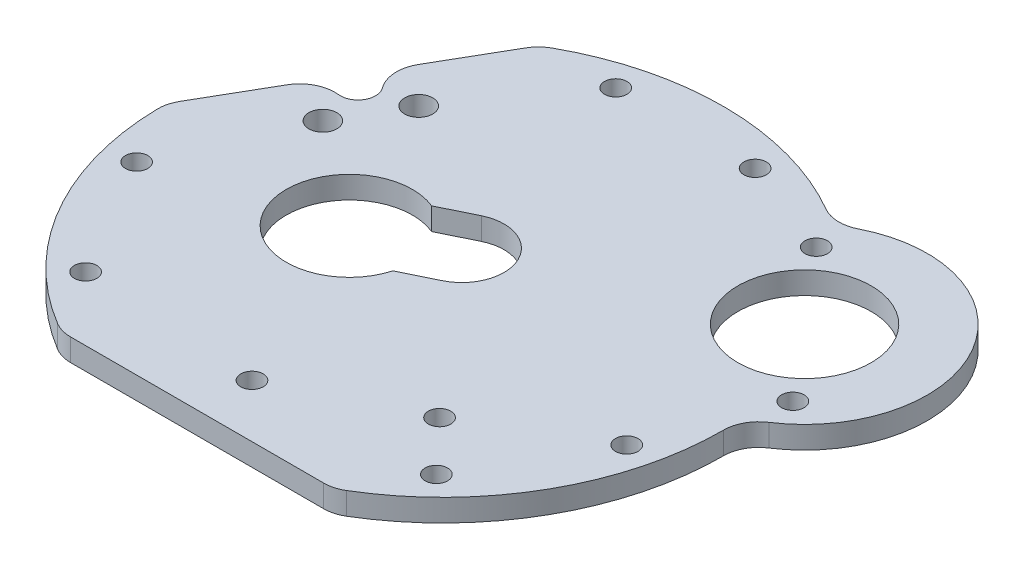
ISO-10303-21;
HEADER;
FILE_DESCRIPTION(('STEP AP214'),'2;1');
FILE_NAME('part.step','',(''),(''),'','','');
FILE_SCHEMA(('AUTOMOTIVE_DESIGN { 1 0 10303 214 1 1 1 1 }'));
ENDSEC;
DATA;
#1=APPLICATION_CONTEXT('core data for automotive mechanical design processes');
#2=APPLICATION_PROTOCOL_DEFINITION('international standard','automotive_design',2000,#1);
#3=PRODUCT_CONTEXT('',#1,'mechanical');
#4=PRODUCT('Part','Part','',(#3));
#5=PRODUCT_RELATED_PRODUCT_CATEGORY('part','',(#4));
#6=PRODUCT_DEFINITION_FORMATION('','',#4);
#7=PRODUCT_DEFINITION_CONTEXT('part definition',#1,'design');
#8=PRODUCT_DEFINITION('design','',#6,#7);
#9=PRODUCT_DEFINITION_SHAPE('','',#8);
#10=(LENGTH_UNIT() NAMED_UNIT(*) SI_UNIT(.MILLI.,.METRE.));
#11=(NAMED_UNIT(*) PLANE_ANGLE_UNIT() SI_UNIT($,.RADIAN.));
#12=(NAMED_UNIT(*) SI_UNIT($,.STERADIAN.) SOLID_ANGLE_UNIT());
#13=UNCERTAINTY_MEASURE_WITH_UNIT(LENGTH_MEASURE(1.E-05),#10,'distance_accuracy_value','');
#14=(GEOMETRIC_REPRESENTATION_CONTEXT(3) GLOBAL_UNCERTAINTY_ASSIGNED_CONTEXT((#13)) GLOBAL_UNIT_ASSIGNED_CONTEXT((#10,
#11,#12)) REPRESENTATION_CONTEXT('',''));
#15=CARTESIAN_POINT('',(0.,0.,0.));
#16=DIRECTION('',(0.,0.,1.));
#17=DIRECTION('',(1.,0.,0.));
#18=AXIS2_PLACEMENT_3D('',#15,#16,#17);
#19=CARTESIAN_POINT('',(-30.3108891324554,3.175,-17.5));
#20=DIRECTION('',(0.866025403784439,0.,0.5));
#21=DIRECTION('',(0.5,0.,-0.866025403784439));
#22=AXIS2_PLACEMENT_3D('',#19,#20,#21);
#23=PLANE('',#22);
#24=DIRECTION('',(-0.5,0.,0.866025403784439));
#25=VECTOR('',#24,1.);
#26=CARTESIAN_POINT('',(-30.3108891324554,3.175,-17.5));
#27=LINE('',#26,#25);
#28=CARTESIAN_POINT('',(-21.2970109437954,3.175,-33.112494995996));
#29=VERTEX_POINT('',#28);
#30=CARTESIAN_POINT('',(-26.8739573612385,3.175,-23.4529404498953));
#31=VERTEX_POINT('',#30);
#32=EDGE_CURVE('E221',#29,#31,#27,.T.);
#33=ORIENTED_EDGE('',*,*,#32,.F.);
#34=DIRECTION('',(0.,-1.,0.));
#35=VECTOR('',#34,1.);
#36=CARTESIAN_POINT('',(-21.2970109437954,3.175,-33.112494995996));
#37=LINE('',#36,#35);
#38=CARTESIAN_POINT('',(-21.2970109437954,0.,-33.112494995996));
#39=VERTEX_POINT('',#38);
#40=EDGE_CURVE('E370',#29,#39,#37,.T.);
#41=ORIENTED_EDGE('',*,*,#40,.T.);
#42=DIRECTION('',(-0.5,0.,0.866025403784439));
#43=VECTOR('',#42,1.);
#44=CARTESIAN_POINT('',(-30.3108891324554,0.,-17.5));
#45=LINE('',#44,#43);
#46=CARTESIAN_POINT('',(-26.8739573612385,0.,-23.4529404498953));
#47=VERTEX_POINT('',#46);
#48=EDGE_CURVE('E290',#39,#47,#45,.T.);
#49=ORIENTED_EDGE('',*,*,#48,.T.);
#50=DIRECTION('',(0.,1.,0.));
#51=VECTOR('',#50,1.);
#52=CARTESIAN_POINT('',(-26.8739573612385,3.175,-23.4529404498953));
#53=LINE('',#52,#51);
#54=EDGE_CURVE('E51',#47,#31,#53,.T.);
#55=ORIENTED_EDGE('',*,*,#54,.T.);
#56=EDGE_LOOP('',(#33,#41,#49,#55));
#57=FACE_BOUND('',#56,.T.);
#58=ADVANCED_FACE('F36',(#57),#23,.F.);
#59=CARTESIAN_POINT('',(32.7031788014801,3.175,-18.8811890843912));
#60=DIRECTION('',(0.,-1.,0.));
#61=DIRECTION('',(0.,0.,-1.));
#62=AXIS2_PLACEMENT_3D('',#59,#60,#61);
#63=CYLINDRICAL_SURFACE('',#62,17.5);
#64=CARTESIAN_POINT('',(32.7031788014801,0.,-18.8811890843912));
#65=DIRECTION('',(0.,1.,0.));
#66=DIRECTION('',(0.,0.,1.));
#67=AXIS2_PLACEMENT_3D('',#64,#65,#66);
#68=CIRCLE('',#67,17.5);
#69=CARTESIAN_POINT('',(42.267360109847,0.,-4.22593624110372));
#70=VERTEX_POINT('',#69);
#71=CARTESIAN_POINT('',(24.7934481944923,0.,-34.4916394854809));
#72=VERTEX_POINT('',#71);
#73=EDGE_CURVE('E281',#70,#72,#68,.T.);
#74=ORIENTED_EDGE('',*,*,#73,.T.);
#75=DIRECTION('',(0.,-1.,0.));
#76=VECTOR('',#75,1.);
#77=CARTESIAN_POINT('',(24.7934481944923,3.175,-34.4916394854809));
#78=LINE('',#77,#76);
#79=CARTESIAN_POINT('',(24.7934481944923,3.175,-34.4916394854809));
#80=VERTEX_POINT('',#79);
#81=EDGE_CURVE('E311',#72,#80,#78,.F.);
#82=ORIENTED_EDGE('',*,*,#81,.T.);
#83=CARTESIAN_POINT('',(32.7031788014801,3.175,-18.8811890843912));
#84=DIRECTION('',(0.,1.,0.));
#85=DIRECTION('',(0.,0.,1.));
#86=AXIS2_PLACEMENT_3D('',#83,#84,#85);
#87=CIRCLE('',#86,17.5);
#88=CARTESIAN_POINT('',(42.267360109847,3.175,-4.22593624110372));
#89=VERTEX_POINT('',#88);
#90=EDGE_CURVE('E214',#89,#80,#87,.T.);
#91=ORIENTED_EDGE('',*,*,#90,.F.);
#92=DIRECTION('',(0.,-1.,0.));
#93=VECTOR('',#92,1.);
#94=CARTESIAN_POINT('',(42.267360109847,3.175,-4.22593624110372));
#95=LINE('',#94,#93);
#96=EDGE_CURVE('E308',#89,#70,#95,.T.);
#97=ORIENTED_EDGE('',*,*,#96,.T.);
#98=EDGE_LOOP('',(#74,#82,#91,#97));
#99=FACE_BOUND('',#98,.T.);
#100=ADVANCED_FACE('F474',(#99),#63,.T.);
#101=CARTESIAN_POINT('',(0.,3.175,0.));
#102=DIRECTION('',(0.,-1.,0.));
#103=DIRECTION('',(0.,0.,-1.));
#104=AXIS2_PLACEMENT_3D('',#101,#102,#103);
#105=CYLINDRICAL_SURFACE('',#104,40.);
#106=CARTESIAN_POINT('',(0.,0.,0.));
#107=DIRECTION('',(0.,1.,0.));
#108=DIRECTION('',(0.,0.,1.));
#109=AXIS2_PLACEMENT_3D('',#106,#107,#108);
#110=CIRCLE('',#109,40.);
#111=CARTESIAN_POINT('',(20.0298001457105,0.,-34.623793930228));
#112=VERTEX_POINT('',#111);
#113=CARTESIAN_POINT('',(-19.3907244855694,0.,-34.9857085668525));
#114=VERTEX_POINT('',#113);
#115=EDGE_CURVE('E284',#112,#114,#110,.T.);
#116=ORIENTED_EDGE('',*,*,#115,.T.);
#117=DIRECTION('',(0.,-1.,0.));
#118=VECTOR('',#117,1.);
#119=CARTESIAN_POINT('',(-19.3907244855694,3.175,-34.9857085668525));
#120=LINE('',#119,#118);
#121=CARTESIAN_POINT('',(-19.3907244855694,3.175,-34.9857085668525));
#122=VERTEX_POINT('',#121);
#123=EDGE_CURVE('E373',#114,#122,#120,.F.);
#124=ORIENTED_EDGE('',*,*,#123,.T.);
#125=CARTESIAN_POINT('',(0.,3.175,0.));
#126=DIRECTION('',(0.,1.,0.));
#127=DIRECTION('',(0.,0.,1.));
#128=AXIS2_PLACEMENT_3D('',#125,#126,#127);
#129=CIRCLE('',#128,40.);
#130=CARTESIAN_POINT('',(20.0298001457105,3.175,-34.623793930228));
#131=VERTEX_POINT('',#130);
#132=EDGE_CURVE('E218',#131,#122,#129,.T.);
#133=ORIENTED_EDGE('',*,*,#132,.F.);
#134=DIRECTION('',(0.,-1.,0.));
#135=VECTOR('',#134,1.);
#136=CARTESIAN_POINT('',(20.0298001457105,3.175,-34.623793930228));
#137=LINE('',#136,#135);
#138=EDGE_CURVE('E186',#131,#112,#137,.T.);
#139=ORIENTED_EDGE('',*,*,#138,.T.);
#140=EDGE_LOOP('',(#116,#124,#133,#139));
#141=FACE_BOUND('',#140,.T.);
#142=ADVANCED_FACE('F480',(#141),#105,.T.);
#143=CARTESIAN_POINT('',(-33.7478209036722,0.,-11.5470595501047));
#144=VERTEX_POINT('',#143);
#145=CARTESIAN_POINT('',(-39.3247673211153,0.,-1.88750500400403));
#146=VERTEX_POINT('',#145);
#147=EDGE_CURVE('E287',#144,#146,#45,.T.);
#148=ORIENTED_EDGE('',*,*,#147,.T.);
#149=DIRECTION('',(0.,-1.,0.));
#150=VECTOR('',#149,1.);
#151=CARTESIAN_POINT('',(-39.3247673211153,3.175,-1.88750500400403));
#152=LINE('',#151,#150);
#153=CARTESIAN_POINT('',(-39.3247673211153,3.175,-1.88750500400403));
#154=VERTEX_POINT('',#153);
#155=EDGE_CURVE('E367',#146,#154,#152,.F.);
#156=ORIENTED_EDGE('',*,*,#155,.T.);
#157=CARTESIAN_POINT('',(-33.7478209036722,3.175,-11.5470595501047));
#158=VERTEX_POINT('',#157);
#159=EDGE_CURVE('E220',#158,#154,#27,.T.);
#160=ORIENTED_EDGE('',*,*,#159,.F.);
#161=DIRECTION('',(0.,1.,0.));
#162=VECTOR('',#161,1.);
#163=CARTESIAN_POINT('',(-33.7478209036722,3.175,-11.5470595501047));
#164=LINE('',#163,#162);
#165=EDGE_CURVE('E365',#158,#144,#164,.F.);
#166=ORIENTED_EDGE('',*,*,#165,.T.);
#167=EDGE_LOOP('',(#148,#156,#160,#166));
#168=FACE_BOUND('',#167,.T.);
#169=ADVANCED_FACE('F476',(#168),#23,.F.);
#170=CARTESIAN_POINT('',(0.,3.175,0.));
#171=DIRECTION('',(0.,-1.,0.));
#172=DIRECTION('',(0.,0.,-1.));
#173=AXIS2_PLACEMENT_3D('',#170,#171,#172);
#174=CYLINDRICAL_SURFACE('',#173,40.);
#175=CARTESIAN_POINT('',(0.,0.,0.));
#176=DIRECTION('',(0.,1.,0.));
#177=DIRECTION('',(0.,0.,1.));
#178=AXIS2_PLACEMENT_3D('',#175,#176,#177);
#179=CIRCLE('',#178,40.);
#180=CARTESIAN_POINT('',(-39.9938746310779,0.,0.699994281138249));
#181=VERTEX_POINT('',#180);
#182=CARTESIAN_POINT('',(-20.6031501455085,0.,34.2857142857143));
#183=VERTEX_POINT('',#182);
#184=EDGE_CURVE('E291',#181,#183,#179,.T.);
#185=ORIENTED_EDGE('',*,*,#184,.T.);
#186=DIRECTION('',(0.,-1.,0.));
#187=VECTOR('',#186,1.);
#188=CARTESIAN_POINT('',(-20.6031501455085,3.175,34.2857142857143));
#189=LINE('',#188,#187);
#190=CARTESIAN_POINT('',(-20.6031501455085,3.175,34.2857142857143));
#191=VERTEX_POINT('',#190);
#192=EDGE_CURVE('E363',#183,#191,#189,.F.);
#193=ORIENTED_EDGE('',*,*,#192,.T.);
#194=CARTESIAN_POINT('',(0.,3.175,0.));
#195=DIRECTION('',(0.,1.,0.));
#196=DIRECTION('',(0.,0.,1.));
#197=AXIS2_PLACEMENT_3D('',#194,#195,#196);
#198=CIRCLE('',#197,40.);
#199=CARTESIAN_POINT('',(-39.9938746310779,3.175,0.699994281138249));
#200=VERTEX_POINT('',#199);
#201=EDGE_CURVE('E223',#200,#191,#198,.T.);
#202=ORIENTED_EDGE('',*,*,#201,.F.);
#203=DIRECTION('',(0.,-1.,0.));
#204=VECTOR('',#203,1.);
#205=CARTESIAN_POINT('',(-39.9938746310778,3.175,0.699994281138249));
#206=LINE('',#205,#204);
#207=EDGE_CURVE('E360',#200,#181,#206,.T.);
#208=ORIENTED_EDGE('',*,*,#207,.T.);
#209=EDGE_LOOP('',(#185,#193,#202,#208));
#210=FACE_BOUND('',#209,.T.);
#211=ADVANCED_FACE('F486',(#210),#174,.T.);
#212=CARTESIAN_POINT('',(0.,3.175,35.));
#213=DIRECTION('',(0.,0.,-1.));
#214=DIRECTION('',(-1.,0.,0.));
#215=AXIS2_PLACEMENT_3D('',#212,#213,#214);
#216=PLANE('',#215);
#217=DIRECTION('',(1.,0.,0.));
#218=VECTOR('',#217,1.);
#219=CARTESIAN_POINT('',(0.,0.,35.));
#220=LINE('',#219,#218);
#221=CARTESIAN_POINT('',(-18.0277563773199,0.,35.));
#222=VERTEX_POINT('',#221);
#223=CARTESIAN_POINT('',(18.0277563773199,0.,35.));
#224=VERTEX_POINT('',#223);
#225=EDGE_CURVE('E294',#222,#224,#220,.T.);
#226=ORIENTED_EDGE('',*,*,#225,.T.);
#227=DIRECTION('',(0.,-1.,0.));
#228=VECTOR('',#227,1.);
#229=CARTESIAN_POINT('',(18.0277563773199,3.175,35.));
#230=LINE('',#229,#228);
#231=CARTESIAN_POINT('',(18.0277563773199,3.175,35.));
#232=VERTEX_POINT('',#231);
#233=EDGE_CURVE('E347',#224,#232,#230,.F.);
#234=ORIENTED_EDGE('',*,*,#233,.T.);
#235=DIRECTION('',(1.,0.,0.));
#236=VECTOR('',#235,1.);
#237=CARTESIAN_POINT('',(0.,3.175,35.));
#238=LINE('',#237,#236);
#239=CARTESIAN_POINT('',(-18.0277563773199,3.175,35.));
#240=VERTEX_POINT('',#239);
#241=EDGE_CURVE('E226',#240,#232,#238,.T.);
#242=ORIENTED_EDGE('',*,*,#241,.F.);
#243=DIRECTION('',(0.,-1.,0.));
#244=VECTOR('',#243,1.);
#245=CARTESIAN_POINT('',(-18.0277563773199,3.175,35.));
#246=LINE('',#245,#244);
#247=EDGE_CURVE('E344',#240,#222,#246,.T.);
#248=ORIENTED_EDGE('',*,*,#247,.T.);
#249=EDGE_LOOP('',(#226,#234,#242,#248));
#250=FACE_BOUND('',#249,.T.);
#251=ADVANCED_FACE('F492',(#250),#216,.F.);
#252=CARTESIAN_POINT('',(-1.1036926971255,3.175,-3.84471877129028));
#253=DIRECTION('',(0.,-1.,0.));
#254=DIRECTION('',(0.,0.,-1.));
#255=AXIS2_PLACEMENT_3D('',#252,#253,#254);
#256=CYLINDRICAL_SURFACE('',#255,5.99999999999999);
#257=CARTESIAN_POINT('',(-1.1036926971255,0.,-3.84471877129028));
#258=DIRECTION('',(0.,1.,0.));
#259=DIRECTION('',(0.,0.,1.));
#260=AXIS2_PLACEMENT_3D('',#257,#258,#259);
#261=CIRCLE('',#260,5.99999999999999);
#262=CARTESIAN_POINT('',(1.52653418360897,0.,1.54804550650471));
#263=VERTEX_POINT('',#262);
#264=CARTESIAN_POINT('',(-3.73391957785997,0.,-9.23748304908527));
#265=VERTEX_POINT('',#264);
#266=EDGE_CURVE('E182',#263,#265,#261,.T.);
#267=ORIENTED_EDGE('',*,*,#266,.F.);
#268=DIRECTION('',(0.,-1.,0.));
#269=VECTOR('',#268,1.);
#270=CARTESIAN_POINT('',(1.52653418360897,3.175,1.54804550650471));
#271=LINE('',#270,#269);
#272=CARTESIAN_POINT('',(1.52653418360897,3.175,1.54804550650471));
#273=VERTEX_POINT('',#272);
#274=EDGE_CURVE('E175',#273,#263,#271,.T.);
#275=ORIENTED_EDGE('',*,*,#274,.F.);
#276=CARTESIAN_POINT('',(-1.1036926971255,3.175,-3.84471877129028));
#277=DIRECTION('',(0.,1.,0.));
#278=DIRECTION('',(0.,0.,1.));
#279=AXIS2_PLACEMENT_3D('',#276,#277,#278);
#280=CIRCLE('',#279,5.99999999999999);
#281=CARTESIAN_POINT('',(-3.73391957785997,3.175,-9.23748304908527));
#282=VERTEX_POINT('',#281);
#283=EDGE_CURVE('E179',#273,#282,#280,.T.);
#284=ORIENTED_EDGE('',*,*,#283,.T.);
#285=DIRECTION('',(0.,-1.,0.));
#286=VECTOR('',#285,1.);
#287=CARTESIAN_POINT('',(-3.73391957785997,3.175,-9.23748304908527));
#288=LINE('',#287,#286);
#289=EDGE_CURVE('E231',#282,#265,#288,.T.);
#290=ORIENTED_EDGE('',*,*,#289,.T.);
#291=EDGE_LOOP('',(#267,#275,#284,#290));
#292=FACE_BOUND('',#291,.T.);
#293=ADVANCED_FACE('F177',(#292),#256,.F.);
#294=CARTESIAN_POINT('',(0.903291201095751,3.175,1.85202141967139));
#295=DIRECTION('',(0.438371146789079,0.,0.898794046299166));
#296=DIRECTION('',(0.898794046299166,0.,-0.438371146789079));
#297=AXIS2_PLACEMENT_3D('',#294,#295,#296);
#298=PLANE('',#297);
#299=DIRECTION('',(-0.898794046299166,0.,0.438371146789079));
#300=VECTOR('',#299,1.);
#301=CARTESIAN_POINT('',(0.903291201095751,0.,1.85202141967139));
#302=LINE('',#301,#300);
#303=CARTESIAN_POINT('',(-3.22970061608986,0.,3.86781621718886));
#304=VERTEX_POINT('',#303);
#305=EDGE_CURVE('E272',#263,#304,#302,.T.);
#306=ORIENTED_EDGE('',*,*,#305,.T.);
#307=DIRECTION('',(0.,-1.,0.));
#308=VECTOR('',#307,1.);
#309=CARTESIAN_POINT('',(-3.22970061608986,3.175,3.86781621718886));
#310=LINE('',#309,#308);
#311=CARTESIAN_POINT('',(-3.22970061608986,3.175,3.86781621718886));
#312=VERTEX_POINT('',#311);
#313=EDGE_CURVE('E187',#312,#304,#310,.T.);
#314=ORIENTED_EDGE('',*,*,#313,.F.);
#315=DIRECTION('',(-0.898794046299166,0.,0.438371146789079));
#316=VECTOR('',#315,1.);
#317=CARTESIAN_POINT('',(0.903291201095751,3.175,1.85202141967139));
#318=LINE('',#317,#316);
#319=EDGE_CURVE('E190',#273,#312,#318,.T.);
#320=ORIENTED_EDGE('',*,*,#319,.F.);
#321=ORIENTED_EDGE('',*,*,#274,.T.);
#322=EDGE_LOOP('',(#306,#314,#320,#321));
#323=FACE_BOUND('',#322,.T.);
#324=ADVANCED_FACE('F191',(#323),#298,.F.);
#325=CARTESIAN_POINT('',(-11.8892212527155,3.175,1.41573499017866));
#326=DIRECTION('',(0.,-1.,0.));
#327=DIRECTION('',(0.,0.,-1.));
#328=AXIS2_PLACEMENT_3D('',#325,#326,#327);
#329=CYLINDRICAL_SURFACE('',#328,9.00000000000007);
#330=CARTESIAN_POINT('',(-11.8892212527155,0.,1.41573499017866));
#331=DIRECTION('',(0.,1.,0.));
#332=DIRECTION('',(0.,0.,1.));
#333=AXIS2_PLACEMENT_3D('',#330,#331,#332);
#334=CIRCLE('',#333,9.00000000000007);
#335=CARTESIAN_POINT('',(-8.49015437755879,0.,-6.91771233840112));
#336=VERTEX_POINT('',#335);
#337=EDGE_CURVE('E275',#336,#304,#334,.T.);
#338=ORIENTED_EDGE('',*,*,#337,.F.);
#339=DIRECTION('',(0.,-1.,0.));
#340=VECTOR('',#339,1.);
#341=CARTESIAN_POINT('',(-8.49015437755879,3.175,-6.91771233840112));
#342=LINE('',#341,#340);
#343=CARTESIAN_POINT('',(-8.49015437755879,3.175,-6.91771233840112));
#344=VERTEX_POINT('',#343);
#345=EDGE_CURVE('E303',#344,#336,#342,.T.);
#346=ORIENTED_EDGE('',*,*,#345,.F.);
#347=CARTESIAN_POINT('',(-11.8892212527155,3.175,1.41573499017866));
#348=DIRECTION('',(0.,1.,0.));
#349=DIRECTION('',(0.,0.,1.));
#350=AXIS2_PLACEMENT_3D('',#347,#348,#349);
#351=CIRCLE('',#350,9.00000000000007);
#352=EDGE_CURVE('E195',#344,#312,#351,.T.);
#353=ORIENTED_EDGE('',*,*,#352,.T.);
#354=ORIENTED_EDGE('',*,*,#313,.T.);
#355=EDGE_LOOP('',(#338,#346,#353,#354));
#356=FACE_BOUND('',#355,.T.);
#357=ADVANCED_FACE('F464',(#356),#329,.F.);
#358=CARTESIAN_POINT('',(-4.35716256037318,3.175,-8.93350713591859));
#359=DIRECTION('',(0.438371146789078,0.,0.898794046299167));
#360=DIRECTION('',(0.898794046299167,0.,-0.438371146789078));
#361=AXIS2_PLACEMENT_3D('',#358,#359,#360);
#362=PLANE('',#361);
#363=DIRECTION('',(-0.898794046299167,0.,0.438371146789078));
#364=VECTOR('',#363,1.);
#365=CARTESIAN_POINT('',(-4.35716256037318,0.,-8.93350713591859));
#366=LINE('',#365,#364);
#367=EDGE_CURVE('E278',#265,#336,#366,.T.);
#368=ORIENTED_EDGE('',*,*,#367,.F.);
#369=ORIENTED_EDGE('',*,*,#289,.F.);
#370=DIRECTION('',(-0.898794046299167,0.,0.438371146789078));
#371=VECTOR('',#370,1.);
#372=CARTESIAN_POINT('',(-4.35716256037318,3.175,-8.93350713591859));
#373=LINE('',#372,#371);
#374=EDGE_CURVE('E199',#282,#344,#373,.T.);
#375=ORIENTED_EDGE('',*,*,#374,.T.);
#376=ORIENTED_EDGE('',*,*,#345,.T.);
#377=EDGE_LOOP('',(#368,#369,#375,#376));
#378=FACE_BOUND('',#377,.T.);
#379=ADVANCED_FACE('F451',(#378),#362,.T.);
#380=CARTESIAN_POINT('',(-34.9332342741632,3.175,8.69880124766783));
#381=DIRECTION('',(0.,-1.,0.));
#382=DIRECTION('',(0.,0.,-1.));
#383=AXIS2_PLACEMENT_3D('',#380,#381,#382);
#384=CYLINDRICAL_SURFACE('',#383,1.599999999409);
#385=CARTESIAN_POINT('',(-34.9332342741632,3.175,8.69880124766783));
#386=DIRECTION('',(0.,1.,0.));
#387=DIRECTION('',(0.,0.,1.));
#388=AXIS2_PLACEMENT_3D('',#385,#386,#387);
#389=CIRCLE('',#388,1.599999999409);
#390=CARTESIAN_POINT('',(-34.9332342741632,3.175,10.2988012470768));
#391=VERTEX_POINT('',#390);
#392=EDGE_CURVE('E201',#391,#391,#389,.T.);
#393=ORIENTED_EDGE('',*,*,#392,.T.);
#394=EDGE_LOOP('',(#393));
#395=FACE_BOUND('',#394,.T.);
#396=CARTESIAN_POINT('',(-34.9332342741632,0.,8.69880124766783));
#397=DIRECTION('',(0.,1.,0.));
#398=DIRECTION('',(0.,0.,1.));
#399=AXIS2_PLACEMENT_3D('',#396,#397,#398);
#400=CIRCLE('',#399,1.599999999409);
#401=CARTESIAN_POINT('',(-34.9332342741632,0.,10.2988012470768));
#402=VERTEX_POINT('',#401);
#403=EDGE_CURVE('E268',#402,#402,#400,.T.);
#404=ORIENTED_EDGE('',*,*,#403,.F.);
#405=EDGE_LOOP('',(#404));
#406=FACE_BOUND('',#405,.T.);
#407=ADVANCED_FACE('F448',(#395,#406),#384,.F.);
#408=CARTESIAN_POINT('',(25.0000000000337,3.175,25.9036676939446));
#409=DIRECTION('',(0.,-1.,0.));
#410=DIRECTION('',(0.,0.,-1.));
#411=AXIS2_PLACEMENT_3D('',#408,#409,#410);
#412=CYLINDRICAL_SURFACE('',#411,1.599999999409);
#413=CARTESIAN_POINT('',(25.0000000000337,3.175,25.9036676939446));
#414=DIRECTION('',(0.,1.,0.));
#415=DIRECTION('',(0.,0.,1.));
#416=AXIS2_PLACEMENT_3D('',#413,#414,#415);
#417=CIRCLE('',#416,1.599999999409);
#418=CARTESIAN_POINT('',(25.0000000000337,3.175,27.5036676933536));
#419=VERTEX_POINT('',#418);
#420=EDGE_CURVE('E207',#419,#419,#417,.T.);
#421=ORIENTED_EDGE('',*,*,#420,.T.);
#422=EDGE_LOOP('',(#421));
#423=FACE_BOUND('',#422,.T.);
#424=CARTESIAN_POINT('',(25.0000000000337,0.,25.9036676939446));
#425=DIRECTION('',(0.,1.,0.));
#426=DIRECTION('',(0.,0.,1.));
#427=AXIS2_PLACEMENT_3D('',#424,#425,#426);
#428=CIRCLE('',#427,1.599999999409);
#429=CARTESIAN_POINT('',(25.0000000000337,0.,27.5036676933536));
#430=VERTEX_POINT('',#429);
#431=EDGE_CURVE('E265',#430,#430,#428,.T.);
#432=ORIENTED_EDGE('',*,*,#431,.F.);
#433=EDGE_LOOP('',(#432));
#434=FACE_BOUND('',#433,.T.);
#435=ADVANCED_FACE('F439',(#423,#434),#412,.F.);
#436=CARTESIAN_POINT('',(0.24263363698146,3.175,27.4303096923593));
#437=DIRECTION('',(0.,-1.,0.));
#438=DIRECTION('',(0.,0.,-1.));
#439=AXIS2_PLACEMENT_3D('',#436,#437,#438);
#440=CYLINDRICAL_SURFACE('',#439,1.599999999409);
#441=CARTESIAN_POINT('',(0.24263363698146,3.175,27.4303096923593));
#442=DIRECTION('',(0.,1.,0.));
#443=DIRECTION('',(0.,0.,1.));
#444=AXIS2_PLACEMENT_3D('',#441,#442,#443);
#445=CIRCLE('',#444,1.599999999409);
#446=CARTESIAN_POINT('',(0.24263363698146,3.175,29.0303096917683));
#447=VERTEX_POINT('',#446);
#448=EDGE_CURVE('E433',#447,#447,#445,.T.);
#449=ORIENTED_EDGE('',*,*,#448,.T.);
#450=EDGE_LOOP('',(#449));
#451=FACE_BOUND('',#450,.T.);
#452=CARTESIAN_POINT('',(0.24263363698146,0.,27.4303096923593));
#453=DIRECTION('',(0.,1.,0.));
#454=DIRECTION('',(0.,0.,1.));
#455=AXIS2_PLACEMENT_3D('',#452,#453,#454);
#456=CIRCLE('',#455,1.599999999409);
#457=CARTESIAN_POINT('',(0.24263363698146,0.,29.0303096917683));
#458=VERTEX_POINT('',#457);
#459=EDGE_CURVE('E262',#458,#458,#456,.T.);
#460=ORIENTED_EDGE('',*,*,#459,.F.);
#461=EDGE_LOOP('',(#460));
#462=FACE_BOUND('',#461,.T.);
#463=ADVANCED_FACE('F591',(#451,#462),#440,.F.);
#464=CARTESIAN_POINT('',(-25.0000000000337,3.175,25.9036676939447));
#465=DIRECTION('',(0.,-1.,0.));
#466=DIRECTION('',(0.,0.,-1.));
#467=AXIS2_PLACEMENT_3D('',#464,#465,#466);
#468=CYLINDRICAL_SURFACE('',#467,1.599999999409);
#469=CARTESIAN_POINT('',(-25.0000000000337,3.175,25.9036676939447));
#470=DIRECTION('',(0.,1.,0.));
#471=DIRECTION('',(0.,0.,1.));
#472=AXIS2_PLACEMENT_3D('',#469,#470,#471);
#473=CIRCLE('',#472,1.599999999409);
#474=CARTESIAN_POINT('',(-25.0000000000337,3.175,27.5036676933537));
#475=VERTEX_POINT('',#474);
#476=EDGE_CURVE('E430',#475,#475,#473,.T.);
#477=ORIENTED_EDGE('',*,*,#476,.T.);
#478=EDGE_LOOP('',(#477));
#479=FACE_BOUND('',#478,.T.);
#480=CARTESIAN_POINT('',(-25.0000000000337,0.,25.9036676939447));
#481=DIRECTION('',(0.,1.,0.));
#482=DIRECTION('',(0.,0.,1.));
#483=AXIS2_PLACEMENT_3D('',#480,#481,#482);
#484=CIRCLE('',#483,1.599999999409);
#485=CARTESIAN_POINT('',(-25.0000000000337,0.,27.5036676933537));
#486=VERTEX_POINT('',#485);
#487=EDGE_CURVE('E259',#486,#486,#484,.T.);
#488=ORIENTED_EDGE('',*,*,#487,.F.);
#489=EDGE_LOOP('',(#488));
#490=FACE_BOUND('',#489,.T.);
#491=ADVANCED_FACE('F587',(#479,#490),#468,.F.);
#492=CARTESIAN_POINT('',(18.2185145629648,3.175,18.6628867565777));
#493=DIRECTION('',(0.,-1.,0.));
#494=DIRECTION('',(0.,0.,-1.));
#495=AXIS2_PLACEMENT_3D('',#492,#493,#494);
#496=CYLINDRICAL_SURFACE('',#495,1.599999999409);
#497=CARTESIAN_POINT('',(18.2185145629648,3.175,18.6628867565777));
#498=DIRECTION('',(0.,1.,0.));
#499=DIRECTION('',(0.,0.,1.));
#500=AXIS2_PLACEMENT_3D('',#497,#498,#499);
#501=CIRCLE('',#500,1.599999999409);
#502=CARTESIAN_POINT('',(18.2185145629648,3.175,20.2628867559867));
#503=VERTEX_POINT('',#502);
#504=EDGE_CURVE('E427',#503,#503,#501,.T.);
#505=ORIENTED_EDGE('',*,*,#504,.T.);
#506=EDGE_LOOP('',(#505));
#507=FACE_BOUND('',#506,.T.);
#508=CARTESIAN_POINT('',(18.2185145629648,0.,18.6628867565777));
#509=DIRECTION('',(0.,1.,0.));
#510=DIRECTION('',(0.,0.,1.));
#511=AXIS2_PLACEMENT_3D('',#508,#509,#510);
#512=CIRCLE('',#511,1.599999999409);
#513=CARTESIAN_POINT('',(18.2185145629648,0.,20.2628867559867));
#514=VERTEX_POINT('',#513);
#515=EDGE_CURVE('E255',#514,#514,#512,.T.);
#516=ORIENTED_EDGE('',*,*,#515,.F.);
#517=EDGE_LOOP('',(#516));
#518=FACE_BOUND('',#517,.T.);
#519=ADVANCED_FACE('F583',(#507,#518),#496,.F.);
#520=CARTESIAN_POINT('',(9.93323427412944,3.175,-34.6024689416125));
#521=DIRECTION('',(0.,-1.,0.));
#522=DIRECTION('',(0.,0.,-1.));
#523=AXIS2_PLACEMENT_3D('',#520,#521,#522);
#524=CYLINDRICAL_SURFACE('',#523,1.599999999409);
#525=CARTESIAN_POINT('',(9.93323427412944,3.175,-34.6024689416125));
#526=DIRECTION('',(0.,1.,0.));
#527=DIRECTION('',(0.,0.,1.));
#528=AXIS2_PLACEMENT_3D('',#525,#526,#527);
#529=CIRCLE('',#528,1.599999999409);
#530=CARTESIAN_POINT('',(9.93323427412944,3.175,-33.0024689422035));
#531=VERTEX_POINT('',#530);
#532=EDGE_CURVE('E424',#531,#531,#529,.T.);
#533=ORIENTED_EDGE('',*,*,#532,.T.);
#534=EDGE_LOOP('',(#533));
#535=FACE_BOUND('',#534,.T.);
#536=CARTESIAN_POINT('',(9.93323427412944,0.,-34.6024689416125));
#537=DIRECTION('',(0.,1.,0.));
#538=DIRECTION('',(0.,0.,1.));
#539=AXIS2_PLACEMENT_3D('',#536,#537,#538);
#540=CIRCLE('',#539,1.599999999409);
#541=CARTESIAN_POINT('',(9.93323427412944,0.,-33.0024689422035));
#542=VERTEX_POINT('',#541);
#543=EDGE_CURVE('E252',#542,#542,#540,.T.);
#544=ORIENTED_EDGE('',*,*,#543,.F.);
#545=EDGE_LOOP('',(#544));
#546=FACE_BOUND('',#545,.T.);
#547=ADVANCED_FACE('F579',(#535,#546),#524,.F.);
#548=CARTESIAN_POINT('',(41.3808115322484,3.175,-8.53958910228498));
#549=DIRECTION('',(0.,-1.,0.));
#550=DIRECTION('',(0.,0.,-1.));
#551=AXIS2_PLACEMENT_3D('',#548,#549,#550);
#552=CYLINDRICAL_SURFACE('',#551,1.599999999409);
#553=CARTESIAN_POINT('',(41.3808115322484,3.175,-8.53958910228498));
#554=DIRECTION('',(0.,1.,0.));
#555=DIRECTION('',(0.,0.,1.));
#556=AXIS2_PLACEMENT_3D('',#553,#554,#555);
#557=CIRCLE('',#556,1.599999999409);
#558=CARTESIAN_POINT('',(41.3808115322484,3.175,-6.93958910287598));
#559=VERTEX_POINT('',#558);
#560=EDGE_CURVE('E420',#559,#559,#557,.T.);
#561=ORIENTED_EDGE('',*,*,#560,.T.);
#562=EDGE_LOOP('',(#561));
#563=FACE_BOUND('',#562,.T.);
#564=CARTESIAN_POINT('',(41.3808115322484,0.,-8.53958910228498));
#565=DIRECTION('',(0.,1.,0.));
#566=DIRECTION('',(0.,0.,1.));
#567=AXIS2_PLACEMENT_3D('',#564,#565,#566);
#568=CIRCLE('',#567,1.599999999409);
#569=CARTESIAN_POINT('',(41.3808115322484,0.,-6.93958910287598));
#570=VERTEX_POINT('',#569);
#571=EDGE_CURVE('E248',#570,#570,#568,.T.);
#572=ORIENTED_EDGE('',*,*,#571,.F.);
#573=EDGE_LOOP('',(#572));
#574=FACE_BOUND('',#573,.T.);
#575=ADVANCED_FACE('F575',(#563,#574),#552,.F.);
#576=CARTESIAN_POINT('',(24.0255460707119,3.175,-29.2227890664975));
#577=DIRECTION('',(0.,-1.,0.));
#578=DIRECTION('',(0.,0.,-1.));
#579=AXIS2_PLACEMENT_3D('',#576,#577,#578);
#580=CYLINDRICAL_SURFACE('',#579,1.599999999409);
#581=CARTESIAN_POINT('',(24.0255460707119,3.175,-29.2227890664975));
#582=DIRECTION('',(0.,1.,0.));
#583=DIRECTION('',(0.,0.,1.));
#584=AXIS2_PLACEMENT_3D('',#581,#582,#583);
#585=CIRCLE('',#584,1.599999999409);
#586=CARTESIAN_POINT('',(24.0255460707119,3.175,-27.6227890670885));
#587=VERTEX_POINT('',#586);
#588=EDGE_CURVE('E416',#587,#587,#585,.T.);
#589=ORIENTED_EDGE('',*,*,#588,.T.);
#590=EDGE_LOOP('',(#589));
#591=FACE_BOUND('',#590,.T.);
#592=CARTESIAN_POINT('',(24.0255460707119,0.,-29.2227890664975));
#593=DIRECTION('',(0.,1.,0.));
#594=DIRECTION('',(0.,0.,1.));
#595=AXIS2_PLACEMENT_3D('',#592,#593,#594);
#596=CIRCLE('',#595,1.599999999409);
#597=CARTESIAN_POINT('',(24.0255460707119,0.,-27.6227890670885));
#598=VERTEX_POINT('',#597);
#599=EDGE_CURVE('E244',#598,#598,#596,.T.);
#600=ORIENTED_EDGE('',*,*,#599,.F.);
#601=EDGE_LOOP('',(#600));
#602=FACE_BOUND('',#601,.T.);
#603=ADVANCED_FACE('F571',(#591,#602),#580,.F.);
#604=CARTESIAN_POINT('',(34.9332342741632,3.175,8.69880124766781));
#605=DIRECTION('',(0.,-1.,0.));
#606=DIRECTION('',(0.,0.,-1.));
#607=AXIS2_PLACEMENT_3D('',#604,#605,#606);
#608=CYLINDRICAL_SURFACE('',#607,1.59999999940897);
#609=CARTESIAN_POINT('',(34.9332342741632,3.175,8.69880124766781));
#610=DIRECTION('',(0.,1.,0.));
#611=DIRECTION('',(0.,0.,1.));
#612=AXIS2_PLACEMENT_3D('',#609,#610,#611);
#613=CIRCLE('',#612,1.59999999940897);
#614=CARTESIAN_POINT('',(34.9332342741632,3.175,10.2988012470768));
#615=VERTEX_POINT('',#614);
#616=EDGE_CURVE('E413',#615,#615,#613,.T.);
#617=ORIENTED_EDGE('',*,*,#616,.T.);
#618=EDGE_LOOP('',(#617));
#619=FACE_BOUND('',#618,.T.);
#620=CARTESIAN_POINT('',(34.9332342741632,0.,8.69880124766781));
#621=DIRECTION('',(0.,1.,0.));
#622=DIRECTION('',(0.,0.,1.));
#623=AXIS2_PLACEMENT_3D('',#620,#621,#622);
#624=CIRCLE('',#623,1.59999999940897);
#625=CARTESIAN_POINT('',(34.9332342741632,0.,10.2988012470768));
#626=VERTEX_POINT('',#625);
#627=EDGE_CURVE('E240',#626,#626,#624,.T.);
#628=ORIENTED_EDGE('',*,*,#627,.F.);
#629=EDGE_LOOP('',(#628));
#630=FACE_BOUND('',#629,.T.);
#631=ADVANCED_FACE('F567',(#619,#630),#608,.F.);
#632=CARTESIAN_POINT('',(-9.93323427412952,3.175,-34.6024689416125));
#633=DIRECTION('',(0.,-1.,0.));
#634=DIRECTION('',(0.,0.,-1.));
#635=AXIS2_PLACEMENT_3D('',#632,#633,#634);
#636=CYLINDRICAL_SURFACE('',#635,1.599999999409);
#637=CARTESIAN_POINT('',(-9.93323427412952,3.175,-34.6024689416125));
#638=DIRECTION('',(0.,1.,0.));
#639=DIRECTION('',(0.,0.,1.));
#640=AXIS2_PLACEMENT_3D('',#637,#638,#639);
#641=CIRCLE('',#640,1.599999999409);
#642=CARTESIAN_POINT('',(-9.93323427412952,3.175,-33.0024689422035));
#643=VERTEX_POINT('',#642);
#644=EDGE_CURVE('E410',#643,#643,#641,.T.);
#645=ORIENTED_EDGE('',*,*,#644,.T.);
#646=EDGE_LOOP('',(#645));
#647=FACE_BOUND('',#646,.T.);
#648=CARTESIAN_POINT('',(-9.93323427412952,0.,-34.6024689416125));
#649=DIRECTION('',(0.,1.,0.));
#650=DIRECTION('',(0.,0.,1.));
#651=AXIS2_PLACEMENT_3D('',#648,#649,#650);
#652=CIRCLE('',#651,1.599999999409);
#653=CARTESIAN_POINT('',(-9.93323427412952,0.,-33.0024689422035));
#654=VERTEX_POINT('',#653);
#655=EDGE_CURVE('E236',#654,#654,#652,.T.);
#656=ORIENTED_EDGE('',*,*,#655,.F.);
#657=EDGE_LOOP('',(#656));
#658=FACE_BOUND('',#657,.T.);
#659=ADVANCED_FACE('F563',(#647,#658),#636,.F.);
#660=CARTESIAN_POINT('',(32.7031788014801,3.175,-18.8811890843912));
#661=DIRECTION('',(0.,-1.,0.));
#662=DIRECTION('',(0.,0.,-1.));
#663=AXIS2_PLACEMENT_3D('',#660,#661,#662);
#664=CYLINDRICAL_SURFACE('',#663,9.50000000000004);
#665=CARTESIAN_POINT('',(32.7031788014801,3.175,-18.8811890843912));
#666=DIRECTION('',(0.,1.,0.));
#667=DIRECTION('',(0.,0.,1.));
#668=AXIS2_PLACEMENT_3D('',#665,#666,#667);
#669=CIRCLE('',#668,9.50000000000004);
#670=CARTESIAN_POINT('',(32.7031788014801,3.175,-9.3811890843912));
#671=VERTEX_POINT('',#670);
#672=EDGE_CURVE('E300',#671,#671,#669,.T.);
#673=ORIENTED_EDGE('',*,*,#672,.T.);
#674=EDGE_LOOP('',(#673));
#675=FACE_BOUND('',#674,.T.);
#676=CARTESIAN_POINT('',(32.7031788014801,0.,-18.8811890843912));
#677=DIRECTION('',(0.,1.,0.));
#678=DIRECTION('',(0.,0.,1.));
#679=AXIS2_PLACEMENT_3D('',#676,#677,#678);
#680=CIRCLE('',#679,9.50000000000004);
#681=CARTESIAN_POINT('',(32.7031788014801,0.,-9.3811890843912));
#682=VERTEX_POINT('',#681);
#683=EDGE_CURVE('E232',#682,#682,#680,.T.);
#684=ORIENTED_EDGE('',*,*,#683,.F.);
#685=EDGE_LOOP('',(#684));
#686=FACE_BOUND('',#685,.T.);
#687=ADVANCED_FACE('F560',(#675,#686),#664,.F.);
#688=CARTESIAN_POINT('',(0.,3.175,0.));
#689=DIRECTION('',(0.,-1.,0.));
#690=DIRECTION('',(0.,0.,-1.));
#691=AXIS2_PLACEMENT_3D('',#688,#689,#690);
#692=CYLINDRICAL_SURFACE('',#691,40.);
#693=CARTESIAN_POINT('',(0.,3.175,0.));
#694=DIRECTION('',(0.,1.,0.));
#695=DIRECTION('',(0.,0.,1.));
#696=AXIS2_PLACEMENT_3D('',#693,#694,#695);
#697=CIRCLE('',#696,40.);
#698=CARTESIAN_POINT('',(20.6031501455085,3.175,34.2857142857143));
#699=VERTEX_POINT('',#698);
#700=CARTESIAN_POINT('',(39.9999851918302,3.175,-0.0344187937969504));
#701=VERTEX_POINT('',#700);
#702=EDGE_CURVE('E229',#699,#701,#697,.T.);
#703=ORIENTED_EDGE('',*,*,#702,.F.);
#704=DIRECTION('',(0.,-1.,0.));
#705=VECTOR('',#704,1.);
#706=CARTESIAN_POINT('',(20.6031501455085,3.175,34.2857142857143));
#707=LINE('',#706,#705);
#708=CARTESIAN_POINT('',(20.6031501455085,0.,34.2857142857143));
#709=VERTEX_POINT('',#708);
#710=EDGE_CURVE('E329',#699,#709,#707,.T.);
#711=ORIENTED_EDGE('',*,*,#710,.T.);
#712=CARTESIAN_POINT('',(0.,0.,0.));
#713=DIRECTION('',(0.,1.,0.));
#714=DIRECTION('',(0.,0.,1.));
#715=AXIS2_PLACEMENT_3D('',#712,#713,#714);
#716=CIRCLE('',#715,40.);
#717=CARTESIAN_POINT('',(39.9999851918302,0.,-0.0344187937969504));
#718=VERTEX_POINT('',#717);
#719=EDGE_CURVE('E298',#709,#718,#716,.T.);
#720=ORIENTED_EDGE('',*,*,#719,.T.);
#721=DIRECTION('',(0.,-1.,0.));
#722=VECTOR('',#721,1.);
#723=CARTESIAN_POINT('',(39.9999851918302,3.175,-0.0344187937969504));
#724=LINE('',#723,#722);
#725=EDGE_CURVE('E314',#718,#701,#724,.F.);
#726=ORIENTED_EDGE('',*,*,#725,.T.);
#727=EDGE_LOOP('',(#703,#711,#720,#726));
#728=FACE_BOUND('',#727,.T.);
#729=ADVANCED_FACE('F444',(#728),#692,.T.);
#730=CARTESIAN_POINT('',(0.,3.175,0.));
#731=DIRECTION('',(0.,1.,0.));
#732=DIRECTION('',(0.,0.,1.));
#733=AXIS2_PLACEMENT_3D('',#730,#731,#732);
#734=PLANE('',#733);
#735=ORIENTED_EDGE('',*,*,#241,.T.);
#736=CARTESIAN_POINT('',(18.0277563773199,3.175,30.));
#737=DIRECTION('',(0.,1.,0.));
#738=DIRECTION('',(0.,0.,1.));
#739=AXIS2_PLACEMENT_3D('',#736,#737,#738);
#740=CIRCLE('',#739,5.);
#741=EDGE_CURVE('E358',#232,#699,#740,.T.);
#742=ORIENTED_EDGE('',*,*,#741,.T.);
#743=ORIENTED_EDGE('',*,*,#702,.T.);
#744=CARTESIAN_POINT('',(44.9999833408089,3.175,-0.0387211430215688));
#745=DIRECTION('',(0.,1.,0.));
#746=DIRECTION('',(0.,0.,1.));
#747=AXIS2_PLACEMENT_3D('',#744,#745,#746);
#748=CIRCLE('',#747,5.);
#749=EDGE_CURVE('E326',#701,#89,#748,.F.);
#750=ORIENTED_EDGE('',*,*,#749,.T.);
#751=ORIENTED_EDGE('',*,*,#90,.T.);
#752=CARTESIAN_POINT('',(22.5335251639243,3.175,-38.9517681715065));
#753=DIRECTION('',(0.,1.,0.));
#754=DIRECTION('',(0.,0.,1.));
#755=AXIS2_PLACEMENT_3D('',#752,#753,#754);
#756=CIRCLE('',#755,5.);
#757=EDGE_CURVE('E321',#80,#131,#756,.F.);
#758=ORIENTED_EDGE('',*,*,#757,.T.);
#759=ORIENTED_EDGE('',*,*,#132,.T.);
#760=CARTESIAN_POINT('',(-16.9668839248732,3.175,-30.612494995996));
#761=DIRECTION('',(0.,1.,0.));
#762=DIRECTION('',(0.,0.,1.));
#763=AXIS2_PLACEMENT_3D('',#760,#761,#762);
#764=CIRCLE('',#763,5.);
#765=EDGE_CURVE('E58',#122,#29,#764,.T.);
#766=ORIENTED_EDGE('',*,*,#765,.T.);
#767=ORIENTED_EDGE('',*,*,#32,.T.);
#768=CARTESIAN_POINT('',(-22.5438303423163,3.175,-20.9529404498953));
#769=DIRECTION('',(0.,1.,0.));
#770=DIRECTION('',(0.,0.,1.));
#771=AXIS2_PLACEMENT_3D('',#768,#769,#770);
#772=CIRCLE('',#771,5.);
#773=CARTESIAN_POINT('',(-26.5671689973631,3.175,-17.9843134832984));
#774=VERTEX_POINT('',#773);
#775=EDGE_CURVE('E349',#31,#774,#772,.T.);
#776=ORIENTED_EDGE('',*,*,#775,.T.);
#777=CARTESIAN_POINT('',(-28.5788383248865,3.175,-16.5));
#778=DIRECTION('',(0.,1.,0.));
#779=DIRECTION('',(0.,0.,1.));
#780=AXIS2_PLACEMENT_3D('',#777,#778,#779);
#781=CIRCLE('',#780,2.5);
#782=CARTESIAN_POINT('',(-28.858456844841,3.175,-14.0156865167016));
#783=VERTEX_POINT('',#782);
#784=EDGE_CURVE('E384',#783,#774,#781,.T.);
#785=ORIENTED_EDGE('',*,*,#784,.F.);
#786=CARTESIAN_POINT('',(-29.4176938847501,3.175,-9.04705955010467));
#787=DIRECTION('',(0.,1.,0.));
#788=DIRECTION('',(0.,0.,1.));
#789=AXIS2_PLACEMENT_3D('',#786,#787,#788);
#790=CIRCLE('',#789,5.);
#791=EDGE_CURVE('E351',#783,#158,#790,.T.);
#792=ORIENTED_EDGE('',*,*,#791,.T.);
#793=ORIENTED_EDGE('',*,*,#159,.T.);
#794=CARTESIAN_POINT('',(-34.9946403021931,3.175,0.612494995995968));
#795=DIRECTION('',(0.,1.,0.));
#796=DIRECTION('',(0.,0.,1.));
#797=AXIS2_PLACEMENT_3D('',#794,#795,#796);
#798=CIRCLE('',#797,5.);
#799=EDGE_CURVE('E354',#154,#200,#798,.T.);
#800=ORIENTED_EDGE('',*,*,#799,.T.);
#801=ORIENTED_EDGE('',*,*,#201,.T.);
#802=CARTESIAN_POINT('',(-18.0277563773199,3.175,30.));
#803=DIRECTION('',(0.,1.,0.));
#804=DIRECTION('',(0.,0.,1.));
#805=AXIS2_PLACEMENT_3D('',#802,#803,#804);
#806=CIRCLE('',#805,5.);
#807=EDGE_CURVE('E356',#191,#240,#806,.T.);
#808=ORIENTED_EDGE('',*,*,#807,.T.);
#809=EDGE_LOOP('',(#735,#742,#743,#750,#751,#758,#759,#766,#767,#776,#785,#792,#793,#800,#801,#808));
#810=FACE_BOUND('',#809,.T.);
#811=CARTESIAN_POINT('',(-21.7487113059643,3.175,-18.3301270189222));
#812=DIRECTION('',(0.,1.,0.));
#813=DIRECTION('',(0.,0.,1.));
#814=AXIS2_PLACEMENT_3D('',#811,#812,#813);
#815=CIRCLE('',#814,2.00000000000001);
#816=CARTESIAN_POINT('',(-21.7487113059643,3.175,-16.3301270189222));
#817=VERTEX_POINT('',#816);
#818=EDGE_CURVE('E394',#817,#817,#815,.T.);
#819=ORIENTED_EDGE('',*,*,#818,.F.);
#820=EDGE_LOOP('',(#819));
#821=FACE_BOUND('',#820,.T.);
#822=CARTESIAN_POINT('',(-26.7487113059643,3.175,-9.6698729810778));
#823=DIRECTION('',(0.,1.,0.));
#824=DIRECTION('',(0.,0.,1.));
#825=AXIS2_PLACEMENT_3D('',#822,#823,#824);
#826=CIRCLE('',#825,2.);
#827=CARTESIAN_POINT('',(-26.7487113059643,3.175,-7.6698729810778));
#828=VERTEX_POINT('',#827);
#829=EDGE_CURVE('E402',#828,#828,#826,.T.);
#830=ORIENTED_EDGE('',*,*,#829,.F.);
#831=EDGE_LOOP('',(#830));
#832=FACE_BOUND('',#831,.T.);
#833=ORIENTED_EDGE('',*,*,#672,.F.);
#834=EDGE_LOOP('',(#833));
#835=FACE_BOUND('',#834,.T.);
#836=ORIENTED_EDGE('',*,*,#644,.F.);
#837=EDGE_LOOP('',(#836));
#838=FACE_BOUND('',#837,.T.);
#839=ORIENTED_EDGE('',*,*,#616,.F.);
#840=EDGE_LOOP('',(#839));
#841=FACE_BOUND('',#840,.T.);
#842=ORIENTED_EDGE('',*,*,#588,.F.);
#843=EDGE_LOOP('',(#842));
#844=FACE_BOUND('',#843,.T.);
#845=ORIENTED_EDGE('',*,*,#560,.F.);
#846=EDGE_LOOP('',(#845));
#847=FACE_BOUND('',#846,.T.);
#848=ORIENTED_EDGE('',*,*,#532,.F.);
#849=EDGE_LOOP('',(#848));
#850=FACE_BOUND('',#849,.T.);
#851=ORIENTED_EDGE('',*,*,#504,.F.);
#852=EDGE_LOOP('',(#851));
#853=FACE_BOUND('',#852,.T.);
#854=ORIENTED_EDGE('',*,*,#476,.F.);
#855=EDGE_LOOP('',(#854));
#856=FACE_BOUND('',#855,.T.);
#857=ORIENTED_EDGE('',*,*,#448,.F.);
#858=EDGE_LOOP('',(#857));
#859=FACE_BOUND('',#858,.T.);
#860=ORIENTED_EDGE('',*,*,#420,.F.);
#861=EDGE_LOOP('',(#860));
#862=FACE_BOUND('',#861,.T.);
#863=ORIENTED_EDGE('',*,*,#392,.F.);
#864=EDGE_LOOP('',(#863));
#865=FACE_BOUND('',#864,.T.);
#866=ORIENTED_EDGE('',*,*,#283,.F.);
#867=ORIENTED_EDGE('',*,*,#319,.T.);
#868=ORIENTED_EDGE('',*,*,#352,.F.);
#869=ORIENTED_EDGE('',*,*,#374,.F.);
#870=EDGE_LOOP('',(#866,#867,#868,#869));
#871=FACE_BOUND('',#870,.T.);
#872=ADVANCED_FACE('F197',(#810,#821,#832,#835,#838,#841,#844,#847,#850,#853,#856,#859,#862,
#865,#871),#734,.T.);
#873=CARTESIAN_POINT('',(0.,0.,0.));
#874=DIRECTION('',(0.,1.,0.));
#875=DIRECTION('',(0.,0.,1.));
#876=AXIS2_PLACEMENT_3D('',#873,#874,#875);
#877=PLANE('',#876);
#878=CARTESIAN_POINT('',(-21.7487113059643,0.,-18.3301270189222));
#879=DIRECTION('',(0.,1.,0.));
#880=DIRECTION('',(0.,0.,1.));
#881=AXIS2_PLACEMENT_3D('',#878,#879,#880);
#882=CIRCLE('',#881,2.00000000000001);
#883=CARTESIAN_POINT('',(-21.7487113059643,0.,-16.3301270189222));
#884=VERTEX_POINT('',#883);
#885=EDGE_CURVE('E399',#884,#884,#882,.F.);
#886=ORIENTED_EDGE('',*,*,#885,.F.);
#887=EDGE_LOOP('',(#886));
#888=FACE_BOUND('',#887,.T.);
#889=CARTESIAN_POINT('',(-26.7487113059643,0.,-9.6698729810778));
#890=DIRECTION('',(0.,1.,0.));
#891=DIRECTION('',(0.,0.,1.));
#892=AXIS2_PLACEMENT_3D('',#889,#890,#891);
#893=CIRCLE('',#892,2.);
#894=CARTESIAN_POINT('',(-26.7487113059643,0.,-7.6698729810778));
#895=VERTEX_POINT('',#894);
#896=EDGE_CURVE('E237',#895,#895,#893,.F.);
#897=ORIENTED_EDGE('',*,*,#896,.F.);
#898=EDGE_LOOP('',(#897));
#899=FACE_BOUND('',#898,.T.);
#900=ORIENTED_EDGE('',*,*,#683,.T.);
#901=EDGE_LOOP('',(#900));
#902=FACE_BOUND('',#901,.T.);
#903=ORIENTED_EDGE('',*,*,#655,.T.);
#904=EDGE_LOOP('',(#903));
#905=FACE_BOUND('',#904,.T.);
#906=ORIENTED_EDGE('',*,*,#627,.T.);
#907=EDGE_LOOP('',(#906));
#908=FACE_BOUND('',#907,.T.);
#909=ORIENTED_EDGE('',*,*,#599,.T.);
#910=EDGE_LOOP('',(#909));
#911=FACE_BOUND('',#910,.T.);
#912=ORIENTED_EDGE('',*,*,#571,.T.);
#913=EDGE_LOOP('',(#912));
#914=FACE_BOUND('',#913,.T.);
#915=ORIENTED_EDGE('',*,*,#543,.T.);
#916=EDGE_LOOP('',(#915));
#917=FACE_BOUND('',#916,.T.);
#918=ORIENTED_EDGE('',*,*,#515,.T.);
#919=EDGE_LOOP('',(#918));
#920=FACE_BOUND('',#919,.T.);
#921=ORIENTED_EDGE('',*,*,#487,.T.);
#922=EDGE_LOOP('',(#921));
#923=FACE_BOUND('',#922,.T.);
#924=ORIENTED_EDGE('',*,*,#459,.T.);
#925=EDGE_LOOP('',(#924));
#926=FACE_BOUND('',#925,.T.);
#927=ORIENTED_EDGE('',*,*,#431,.T.);
#928=EDGE_LOOP('',(#927));
#929=FACE_BOUND('',#928,.T.);
#930=ORIENTED_EDGE('',*,*,#403,.T.);
#931=EDGE_LOOP('',(#930));
#932=FACE_BOUND('',#931,.T.);
#933=ORIENTED_EDGE('',*,*,#266,.T.);
#934=ORIENTED_EDGE('',*,*,#367,.T.);
#935=ORIENTED_EDGE('',*,*,#337,.T.);
#936=ORIENTED_EDGE('',*,*,#305,.F.);
#937=EDGE_LOOP('',(#933,#934,#935,#936));
#938=FACE_BOUND('',#937,.T.);
#939=ORIENTED_EDGE('',*,*,#719,.F.);
#940=CARTESIAN_POINT('',(18.0277563773199,0.,30.));
#941=DIRECTION('',(0.,1.,0.));
#942=DIRECTION('',(0.,0.,1.));
#943=AXIS2_PLACEMENT_3D('',#940,#941,#942);
#944=CIRCLE('',#943,5.);
#945=EDGE_CURVE('E342',#709,#224,#944,.F.);
#946=ORIENTED_EDGE('',*,*,#945,.T.);
#947=ORIENTED_EDGE('',*,*,#225,.F.);
#948=CARTESIAN_POINT('',(-18.0277563773199,0.,30.));
#949=DIRECTION('',(0.,1.,0.));
#950=DIRECTION('',(0.,0.,1.));
#951=AXIS2_PLACEMENT_3D('',#948,#949,#950);
#952=CIRCLE('',#951,5.);
#953=EDGE_CURVE('E340',#222,#183,#952,.F.);
#954=ORIENTED_EDGE('',*,*,#953,.T.);
#955=ORIENTED_EDGE('',*,*,#184,.F.);
#956=CARTESIAN_POINT('',(-34.9946403021931,0.,0.612494995995968));
#957=DIRECTION('',(0.,1.,0.));
#958=DIRECTION('',(0.,0.,1.));
#959=AXIS2_PLACEMENT_3D('',#956,#957,#958);
#960=CIRCLE('',#959,5.);
#961=EDGE_CURVE('E338',#181,#146,#960,.F.);
#962=ORIENTED_EDGE('',*,*,#961,.T.);
#963=ORIENTED_EDGE('',*,*,#147,.F.);
#964=CARTESIAN_POINT('',(-29.4176938847501,0.,-9.04705955010467));
#965=DIRECTION('',(0.,1.,0.));
#966=DIRECTION('',(0.,0.,1.));
#967=AXIS2_PLACEMENT_3D('',#964,#965,#966);
#968=CIRCLE('',#967,5.);
#969=CARTESIAN_POINT('',(-28.858456844841,0.,-14.0156865167016));
#970=VERTEX_POINT('',#969);
#971=EDGE_CURVE('E334',#144,#970,#968,.F.);
#972=ORIENTED_EDGE('',*,*,#971,.T.);
#973=CARTESIAN_POINT('',(-28.5788383248865,0.,-16.5));
#974=DIRECTION('',(0.,1.,0.));
#975=DIRECTION('',(0.,0.,1.));
#976=AXIS2_PLACEMENT_3D('',#973,#974,#975);
#977=CIRCLE('',#976,2.5);
#978=CARTESIAN_POINT('',(-26.5671689973631,0.,-17.9843134832984));
#979=VERTEX_POINT('',#978);
#980=EDGE_CURVE('E381',#979,#970,#977,.F.);
#981=ORIENTED_EDGE('',*,*,#980,.F.);
#982=CARTESIAN_POINT('',(-22.5438303423163,0.,-20.9529404498953));
#983=DIRECTION('',(0.,1.,0.));
#984=DIRECTION('',(0.,0.,1.));
#985=AXIS2_PLACEMENT_3D('',#982,#983,#984);
#986=CIRCLE('',#985,5.);
#987=EDGE_CURVE('E332',#979,#47,#986,.F.);
#988=ORIENTED_EDGE('',*,*,#987,.T.);
#989=ORIENTED_EDGE('',*,*,#48,.F.);
#990=CARTESIAN_POINT('',(-16.9668839248732,0.,-30.612494995996));
#991=DIRECTION('',(0.,1.,0.));
#992=DIRECTION('',(0.,0.,1.));
#993=AXIS2_PLACEMENT_3D('',#990,#991,#992);
#994=CIRCLE('',#993,5.);
#995=EDGE_CURVE('E336',#39,#114,#994,.F.);
#996=ORIENTED_EDGE('',*,*,#995,.T.);
#997=ORIENTED_EDGE('',*,*,#115,.F.);
#998=CARTESIAN_POINT('',(22.5335251639243,0.,-38.9517681715065));
#999=DIRECTION('',(0.,1.,0.));
#1000=DIRECTION('',(0.,0.,1.));
#1001=AXIS2_PLACEMENT_3D('',#998,#999,#1000);
#1002=CIRCLE('',#1001,5.);
#1003=EDGE_CURVE('E318',#112,#72,#1002,.T.);
#1004=ORIENTED_EDGE('',*,*,#1003,.T.);
#1005=ORIENTED_EDGE('',*,*,#73,.F.);
#1006=CARTESIAN_POINT('',(44.9999833408089,0.,-0.0387211430215688));
#1007=DIRECTION('',(0.,1.,0.));
#1008=DIRECTION('',(0.,0.,1.));
#1009=AXIS2_PLACEMENT_3D('',#1006,#1007,#1008);
#1010=CIRCLE('',#1009,5.);
#1011=EDGE_CURVE('E323',#70,#718,#1010,.T.);
#1012=ORIENTED_EDGE('',*,*,#1011,.T.);
#1013=EDGE_LOOP('',(#939,#946,#947,#954,#955,#962,#963,#972,#981,#988,#989,#996,#997,#1004,
#1005,#1012));
#1014=FACE_BOUND('',#1013,.T.);
#1015=ADVANCED_FACE('F389',(#888,#899,#902,#905,#908,#911,#914,#917,#920,#923,#926,#929,#932,
#938,#1014),#877,.F.);
#1016=CARTESIAN_POINT('',(22.5335251639243,3.175,-38.9517681715065));
#1017=DIRECTION('',(0.,1.,0.));
#1018=DIRECTION('',(0.,0.,1.));
#1019=AXIS2_PLACEMENT_3D('',#1016,#1017,#1018);
#1020=CYLINDRICAL_SURFACE('',#1019,5.);
#1021=ORIENTED_EDGE('',*,*,#757,.F.);
#1022=ORIENTED_EDGE('',*,*,#81,.F.);
#1023=ORIENTED_EDGE('',*,*,#1003,.F.);
#1024=ORIENTED_EDGE('',*,*,#138,.F.);
#1025=EDGE_LOOP('',(#1021,#1022,#1023,#1024));
#1026=FACE_BOUND('',#1025,.T.);
#1027=ADVANCED_FACE('F457',(#1026),#1020,.F.);
#1028=CARTESIAN_POINT('',(44.9999833408089,3.175,-0.0387211430215688));
#1029=DIRECTION('',(0.,1.,0.));
#1030=DIRECTION('',(0.,0.,1.));
#1031=AXIS2_PLACEMENT_3D('',#1028,#1029,#1030);
#1032=CYLINDRICAL_SURFACE('',#1031,5.);
#1033=ORIENTED_EDGE('',*,*,#749,.F.);
#1034=ORIENTED_EDGE('',*,*,#725,.F.);
#1035=ORIENTED_EDGE('',*,*,#1011,.F.);
#1036=ORIENTED_EDGE('',*,*,#96,.F.);
#1037=EDGE_LOOP('',(#1033,#1034,#1035,#1036));
#1038=FACE_BOUND('',#1037,.T.);
#1039=ADVANCED_FACE('F525',(#1038),#1032,.F.);
#1040=CARTESIAN_POINT('',(-26.7487113059643,-0.00100000000000013,-9.6698729810778));
#1041=DIRECTION('',(0.,1.,0.));
#1042=DIRECTION('',(0.,0.,1.));
#1043=AXIS2_PLACEMENT_3D('',#1040,#1041,#1042);
#1044=CYLINDRICAL_SURFACE('',#1043,2.);
#1045=ORIENTED_EDGE('',*,*,#829,.T.);
#1046=EDGE_LOOP('',(#1045));
#1047=FACE_BOUND('',#1046,.T.);
#1048=ORIENTED_EDGE('',*,*,#896,.T.);
#1049=EDGE_LOOP('',(#1048));
#1050=FACE_BOUND('',#1049,.T.);
#1051=ADVANCED_FACE('F557',(#1047,#1050),#1044,.F.);
#1052=CARTESIAN_POINT('',(-21.7487113059643,-0.00100000000000013,-18.3301270189222));
#1053=DIRECTION('',(0.,1.,0.));
#1054=DIRECTION('',(0.,0.,1.));
#1055=AXIS2_PLACEMENT_3D('',#1052,#1053,#1054);
#1056=CYLINDRICAL_SURFACE('',#1055,2.00000000000001);
#1057=ORIENTED_EDGE('',*,*,#818,.T.);
#1058=EDGE_LOOP('',(#1057));
#1059=FACE_BOUND('',#1058,.T.);
#1060=ORIENTED_EDGE('',*,*,#885,.T.);
#1061=EDGE_LOOP('',(#1060));
#1062=FACE_BOUND('',#1061,.T.);
#1063=ADVANCED_FACE('F610',(#1059,#1062),#1056,.F.);
#1064=CARTESIAN_POINT('',(-28.5788383248865,-0.00100000000000013,-16.5));
#1065=DIRECTION('',(0.,1.,0.));
#1066=DIRECTION('',(0.,0.,1.));
#1067=AXIS2_PLACEMENT_3D('',#1064,#1065,#1066);
#1068=CYLINDRICAL_SURFACE('',#1067,2.5);
#1069=ORIENTED_EDGE('',*,*,#980,.T.);
#1070=DIRECTION('',(0.,1.,0.));
#1071=VECTOR('',#1070,1.);
#1072=CARTESIAN_POINT('',(-28.858456844841,-0.00100000000000013,-14.0156865167016));
#1073=LINE('',#1072,#1071);
#1074=EDGE_CURVE('E11',#970,#783,#1073,.T.);
#1075=ORIENTED_EDGE('',*,*,#1074,.T.);
#1076=ORIENTED_EDGE('',*,*,#784,.T.);
#1077=DIRECTION('',(0.,1.,0.));
#1078=VECTOR('',#1077,1.);
#1079=CARTESIAN_POINT('',(-26.5671689973631,-0.00100000000000013,-17.9843134832984));
#1080=LINE('',#1079,#1078);
#1081=EDGE_CURVE('E44',#774,#979,#1080,.F.);
#1082=ORIENTED_EDGE('',*,*,#1081,.T.);
#1083=EDGE_LOOP('',(#1069,#1075,#1076,#1082));
#1084=FACE_BOUND('',#1083,.T.);
#1085=ADVANCED_FACE('F380',(#1084),#1068,.F.);
#1086=CARTESIAN_POINT('',(18.0277563773199,3.175,30.));
#1087=DIRECTION('',(0.,-1.,0.));
#1088=DIRECTION('',(0.,0.,-1.));
#1089=AXIS2_PLACEMENT_3D('',#1086,#1087,#1088);
#1090=CYLINDRICAL_SURFACE('',#1089,5.);
#1091=ORIENTED_EDGE('',*,*,#741,.F.);
#1092=ORIENTED_EDGE('',*,*,#233,.F.);
#1093=ORIENTED_EDGE('',*,*,#945,.F.);
#1094=ORIENTED_EDGE('',*,*,#710,.F.);
#1095=EDGE_LOOP('',(#1091,#1092,#1093,#1094));
#1096=FACE_BOUND('',#1095,.T.);
#1097=ADVANCED_FACE('F517',(#1096),#1090,.T.);
#1098=CARTESIAN_POINT('',(-18.0277563773199,3.175,30.));
#1099=DIRECTION('',(0.,-1.,0.));
#1100=DIRECTION('',(0.,0.,-1.));
#1101=AXIS2_PLACEMENT_3D('',#1098,#1099,#1100);
#1102=CYLINDRICAL_SURFACE('',#1101,5.);
#1103=ORIENTED_EDGE('',*,*,#807,.F.);
#1104=ORIENTED_EDGE('',*,*,#192,.F.);
#1105=ORIENTED_EDGE('',*,*,#953,.F.);
#1106=ORIENTED_EDGE('',*,*,#247,.F.);
#1107=EDGE_LOOP('',(#1103,#1104,#1105,#1106));
#1108=FACE_BOUND('',#1107,.T.);
#1109=ADVANCED_FACE('F509',(#1108),#1102,.T.);
#1110=CARTESIAN_POINT('',(-34.9946403021931,3.175,0.612494995995968));
#1111=DIRECTION('',(0.,-1.,0.));
#1112=DIRECTION('',(0.,0.,-1.));
#1113=AXIS2_PLACEMENT_3D('',#1110,#1111,#1112);
#1114=CYLINDRICAL_SURFACE('',#1113,5.);
#1115=ORIENTED_EDGE('',*,*,#799,.F.);
#1116=ORIENTED_EDGE('',*,*,#155,.F.);
#1117=ORIENTED_EDGE('',*,*,#961,.F.);
#1118=ORIENTED_EDGE('',*,*,#207,.F.);
#1119=EDGE_LOOP('',(#1115,#1116,#1117,#1118));
#1120=FACE_BOUND('',#1119,.T.);
#1121=ADVANCED_FACE('F501',(#1120),#1114,.T.);
#1122=CARTESIAN_POINT('',(-16.9668839248732,3.175,-30.612494995996));
#1123=DIRECTION('',(0.,-1.,0.));
#1124=DIRECTION('',(0.,0.,-1.));
#1125=AXIS2_PLACEMENT_3D('',#1122,#1123,#1124);
#1126=CYLINDRICAL_SURFACE('',#1125,5.);
#1127=ORIENTED_EDGE('',*,*,#765,.F.);
#1128=ORIENTED_EDGE('',*,*,#123,.F.);
#1129=ORIENTED_EDGE('',*,*,#995,.F.);
#1130=ORIENTED_EDGE('',*,*,#40,.F.);
#1131=EDGE_LOOP('',(#1127,#1128,#1129,#1130));
#1132=FACE_BOUND('',#1131,.T.);
#1133=ADVANCED_FACE('F536',(#1132),#1126,.T.);
#1134=CARTESIAN_POINT('',(-29.4176938847501,-0.00100000000000013,-9.04705955010467));
#1135=DIRECTION('',(0.,1.,0.));
#1136=DIRECTION('',(0.,0.,1.));
#1137=AXIS2_PLACEMENT_3D('',#1134,#1135,#1136);
#1138=CYLINDRICAL_SURFACE('',#1137,5.);
#1139=ORIENTED_EDGE('',*,*,#971,.F.);
#1140=ORIENTED_EDGE('',*,*,#165,.F.);
#1141=ORIENTED_EDGE('',*,*,#791,.F.);
#1142=ORIENTED_EDGE('',*,*,#1074,.F.);
#1143=EDGE_LOOP('',(#1139,#1140,#1141,#1142));
#1144=FACE_BOUND('',#1143,.T.);
#1145=ADVANCED_FACE('F539',(#1144),#1138,.T.);
#1146=CARTESIAN_POINT('',(-22.5438303423163,-0.00100000000000013,-20.9529404498953));
#1147=DIRECTION('',(0.,1.,0.));
#1148=DIRECTION('',(0.,0.,1.));
#1149=AXIS2_PLACEMENT_3D('',#1146,#1147,#1148);
#1150=CYLINDRICAL_SURFACE('',#1149,5.);
#1151=ORIENTED_EDGE('',*,*,#775,.F.);
#1152=ORIENTED_EDGE('',*,*,#54,.F.);
#1153=ORIENTED_EDGE('',*,*,#987,.F.);
#1154=ORIENTED_EDGE('',*,*,#1081,.F.);
#1155=EDGE_LOOP('',(#1151,#1152,#1153,#1154));
#1156=FACE_BOUND('',#1155,.T.);
#1157=ADVANCED_FACE('F38',(#1156),#1150,.T.);
#1158=CLOSED_SHELL('',(#58,#100,#142,#169,#211,#251,#293,#324,#357,#379,#407,#435,#463,#491,
#519,#547,#575,#603,#631,#659,#687,#729,#872,#1015,#1027,#1039,#1051,#1063,#1085,#1097,#1109,
#1121,#1133,#1145,#1157));
#1159=MANIFOLD_SOLID_BREP('B2',#1158);
#1160=ADVANCED_BREP_SHAPE_REPRESENTATION('',(#18,#1159),#14);
#1161=SHAPE_DEFINITION_REPRESENTATION(#9,#1160);
ENDSEC;
END-ISO-10303-21;
